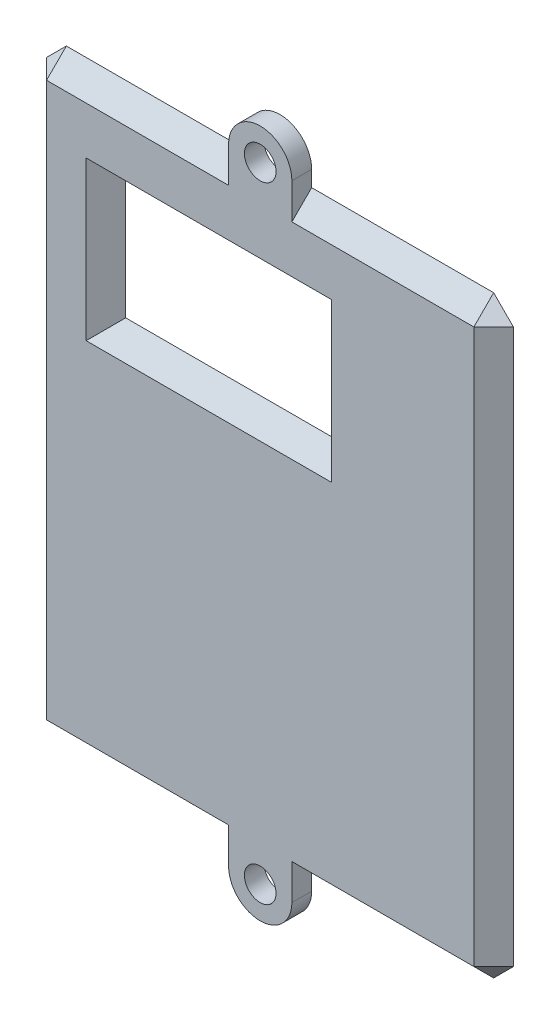
ISO-10303-21;
HEADER;
FILE_DESCRIPTION(('STEP AP214'),'2;1');
FILE_NAME('part.step','',(''),(''),'','','');
FILE_SCHEMA(('AUTOMOTIVE_DESIGN { 1 0 10303 214 1 1 1 1 }'));
ENDSEC;
DATA;
#1=APPLICATION_CONTEXT('core data for automotive mechanical design processes');
#2=APPLICATION_PROTOCOL_DEFINITION('international standard','automotive_design',2000,#1);
#3=PRODUCT_CONTEXT('',#1,'mechanical');
#4=PRODUCT('Part','Part','',(#3));
#5=PRODUCT_RELATED_PRODUCT_CATEGORY('part','',(#4));
#6=PRODUCT_DEFINITION_FORMATION('','',#4);
#7=PRODUCT_DEFINITION_CONTEXT('part definition',#1,'design');
#8=PRODUCT_DEFINITION('design','',#6,#7);
#9=PRODUCT_DEFINITION_SHAPE('','',#8);
#10=(LENGTH_UNIT() NAMED_UNIT(*) SI_UNIT(.MILLI.,.METRE.));
#11=(NAMED_UNIT(*) PLANE_ANGLE_UNIT() SI_UNIT($,.RADIAN.));
#12=(NAMED_UNIT(*) SI_UNIT($,.STERADIAN.) SOLID_ANGLE_UNIT());
#13=UNCERTAINTY_MEASURE_WITH_UNIT(LENGTH_MEASURE(1.E-05),#10,'distance_accuracy_value','');
#14=(GEOMETRIC_REPRESENTATION_CONTEXT(3) GLOBAL_UNCERTAINTY_ASSIGNED_CONTEXT((#13)) GLOBAL_UNIT_ASSIGNED_CONTEXT((#10,
#11,#12)) REPRESENTATION_CONTEXT('',''));
#15=CARTESIAN_POINT('',(0.,0.,0.));
#16=DIRECTION('',(0.,0.,1.));
#17=DIRECTION('',(1.,0.,0.));
#18=AXIS2_PLACEMENT_3D('',#15,#16,#17);
#19=CARTESIAN_POINT('',(37.465,97.79,3.175));
#20=DIRECTION('',(0.,0.,1.));
#21=DIRECTION('',(1.,0.,0.));
#22=AXIS2_PLACEMENT_3D('',#19,#20,#21);
#23=PLANE('',#22);
#24=DIRECTION('',(1.,0.,0.));
#25=VECTOR('',#24,1.);
#26=CARTESIAN_POINT('',(37.465,84.455,3.175));
#27=LINE('',#26,#25);
#28=CARTESIAN_POINT('',(9.52499999999997,84.455,3.175));
#29=VERTEX_POINT('',#28);
#30=CARTESIAN_POINT('',(48.895,84.455,3.175));
#31=VERTEX_POINT('',#30);
#32=EDGE_CURVE('E273',#29,#31,#27,.T.);
#33=ORIENTED_EDGE('',*,*,#32,.T.);
#34=DIRECTION('',(0.,-1.,0.));
#35=VECTOR('',#34,1.);
#36=CARTESIAN_POINT('',(48.895,97.79,3.175));
#37=LINE('',#36,#35);
#38=CARTESIAN_POINT('',(48.895,59.055,3.175));
#39=VERTEX_POINT('',#38);
#40=EDGE_CURVE('E275',#31,#39,#37,.T.);
#41=ORIENTED_EDGE('',*,*,#40,.T.);
#42=DIRECTION('',(-1.,0.,0.));
#43=VECTOR('',#42,1.);
#44=CARTESIAN_POINT('',(37.465,59.055,3.175));
#45=LINE('',#44,#43);
#46=CARTESIAN_POINT('',(9.52499999999997,59.055,3.175));
#47=VERTEX_POINT('',#46);
#48=EDGE_CURVE('E270',#39,#47,#45,.T.);
#49=ORIENTED_EDGE('',*,*,#48,.T.);
#50=DIRECTION('',(0.,1.,0.));
#51=VECTOR('',#50,1.);
#52=CARTESIAN_POINT('',(9.52499999999997,97.79,3.175));
#53=LINE('',#52,#51);
#54=EDGE_CURVE('E180',#47,#29,#53,.T.);
#55=ORIENTED_EDGE('',*,*,#54,.T.);
#56=EDGE_LOOP('',(#33,#41,#49,#55));
#57=FACE_BOUND('',#56,.T.);
#58=DIRECTION('',(0.,1.,0.));
#59=VECTOR('',#58,1.);
#60=CARTESIAN_POINT('',(42.545,-2.54,3.175));
#61=LINE('',#60,#59);
#62=CARTESIAN_POINT('',(42.545,-2.54,3.175));
#63=VERTEX_POINT('',#62);
#64=CARTESIAN_POINT('',(42.545,3.17500000000001,3.175));
#65=VERTEX_POINT('',#64);
#66=EDGE_CURVE('E211',#63,#65,#61,.T.);
#67=ORIENTED_EDGE('',*,*,#66,.T.);
#68=DIRECTION('',(1.,0.,0.));
#69=VECTOR('',#68,1.);
#70=CARTESIAN_POINT('',(74.93,3.17500000000001,3.175));
#71=LINE('',#70,#69);
#72=CARTESIAN_POINT('',(71.755,3.17500000000001,3.175));
#73=VERTEX_POINT('',#72);
#74=EDGE_CURVE('E268',#65,#73,#71,.T.);
#75=ORIENTED_EDGE('',*,*,#74,.T.);
#76=DIRECTION('',(0.,1.,0.));
#77=VECTOR('',#76,1.);
#78=CARTESIAN_POINT('',(71.755,95.25,3.175));
#79=LINE('',#78,#77);
#80=CARTESIAN_POINT('',(71.755,92.075,3.175));
#81=VERTEX_POINT('',#80);
#82=EDGE_CURVE('E263',#73,#81,#79,.T.);
#83=ORIENTED_EDGE('',*,*,#82,.T.);
#84=DIRECTION('',(-1.,0.,0.));
#85=VECTOR('',#84,1.);
#86=CARTESIAN_POINT('',(42.545,92.075,3.175));
#87=LINE('',#86,#85);
#88=CARTESIAN_POINT('',(42.545,92.075,3.175));
#89=VERTEX_POINT('',#88);
#90=EDGE_CURVE('E265',#81,#89,#87,.T.);
#91=ORIENTED_EDGE('',*,*,#90,.T.);
#92=DIRECTION('',(0.,1.,0.));
#93=VECTOR('',#92,1.);
#94=CARTESIAN_POINT('',(42.545,97.79,3.175));
#95=LINE('',#94,#93);
#96=CARTESIAN_POINT('',(42.545,97.79,3.175));
#97=VERTEX_POINT('',#96);
#98=EDGE_CURVE('E213',#89,#97,#95,.T.);
#99=ORIENTED_EDGE('',*,*,#98,.T.);
#100=CARTESIAN_POINT('',(37.465,97.79,3.175));
#101=DIRECTION('',(0.,0.,1.));
#102=DIRECTION('',(1.,0.,0.));
#103=AXIS2_PLACEMENT_3D('',#100,#101,#102);
#104=CIRCLE('',#103,5.08000000000001);
#105=CARTESIAN_POINT('',(32.385,97.79,3.175));
#106=VERTEX_POINT('',#105);
#107=EDGE_CURVE('E215',#97,#106,#104,.T.);
#108=ORIENTED_EDGE('',*,*,#107,.T.);
#109=DIRECTION('',(0.,-1.,0.));
#110=VECTOR('',#109,1.);
#111=CARTESIAN_POINT('',(32.385,97.79,3.175));
#112=LINE('',#111,#110);
#113=CARTESIAN_POINT('',(32.385,92.075,3.175));
#114=VERTEX_POINT('',#113);
#115=EDGE_CURVE('E217',#106,#114,#112,.T.);
#116=ORIENTED_EDGE('',*,*,#115,.T.);
#117=DIRECTION('',(-1.,0.,0.));
#118=VECTOR('',#117,1.);
#119=CARTESIAN_POINT('',(0.,92.075,3.175));
#120=LINE('',#119,#118);
#121=CARTESIAN_POINT('',(3.175,92.075,3.175));
#122=VERTEX_POINT('',#121);
#123=EDGE_CURVE('E258',#114,#122,#120,.T.);
#124=ORIENTED_EDGE('',*,*,#123,.T.);
#125=DIRECTION('',(0.,-1.,0.));
#126=VECTOR('',#125,1.);
#127=CARTESIAN_POINT('',(3.175,0.,3.175));
#128=LINE('',#127,#126);
#129=CARTESIAN_POINT('',(3.175,3.175,3.175));
#130=VERTEX_POINT('',#129);
#131=EDGE_CURVE('E256',#122,#130,#128,.T.);
#132=ORIENTED_EDGE('',*,*,#131,.T.);
#133=DIRECTION('',(1.,0.,0.));
#134=VECTOR('',#133,1.);
#135=CARTESIAN_POINT('',(32.385,3.175,3.175));
#136=LINE('',#135,#134);
#137=CARTESIAN_POINT('',(32.385,3.175,3.175));
#138=VERTEX_POINT('',#137);
#139=EDGE_CURVE('E260',#130,#138,#136,.T.);
#140=ORIENTED_EDGE('',*,*,#139,.T.);
#141=DIRECTION('',(0.,-1.,0.));
#142=VECTOR('',#141,1.);
#143=CARTESIAN_POINT('',(32.385,-2.54,3.175));
#144=LINE('',#143,#142);
#145=CARTESIAN_POINT('',(32.385,-2.54,3.175));
#146=VERTEX_POINT('',#145);
#147=EDGE_CURVE('E206',#138,#146,#144,.T.);
#148=ORIENTED_EDGE('',*,*,#147,.T.);
#149=CARTESIAN_POINT('',(37.465,-2.54,3.175));
#150=DIRECTION('',(0.,0.,1.));
#151=DIRECTION('',(1.,0.,0.));
#152=AXIS2_PLACEMENT_3D('',#149,#150,#151);
#153=CIRCLE('',#152,5.08);
#154=EDGE_CURVE('E208',#146,#63,#153,.T.);
#155=ORIENTED_EDGE('',*,*,#154,.T.);
#156=EDGE_LOOP('',(#67,#75,#83,#91,#99,#108,#116,#124,#132,#140,#148,#155));
#157=FACE_BOUND('',#156,.T.);
#158=CARTESIAN_POINT('',(37.465,-2.54,3.175));
#159=DIRECTION('',(0.,0.,1.));
#160=DIRECTION('',(1.,0.,0.));
#161=AXIS2_PLACEMENT_3D('',#158,#159,#160);
#162=CIRCLE('',#161,2.54);
#163=CARTESIAN_POINT('',(40.005,-2.54,3.175));
#164=VERTEX_POINT('',#163);
#165=EDGE_CURVE('E200',#164,#164,#162,.T.);
#166=ORIENTED_EDGE('',*,*,#165,.F.);
#167=EDGE_LOOP('',(#166));
#168=FACE_BOUND('',#167,.T.);
#169=CARTESIAN_POINT('',(37.465,97.79,3.175));
#170=DIRECTION('',(0.,0.,1.));
#171=DIRECTION('',(1.,0.,0.));
#172=AXIS2_PLACEMENT_3D('',#169,#170,#171);
#173=CIRCLE('',#172,2.54);
#174=CARTESIAN_POINT('',(40.005,97.79,3.175));
#175=VERTEX_POINT('',#174);
#176=EDGE_CURVE('E194',#175,#175,#173,.T.);
#177=ORIENTED_EDGE('',*,*,#176,.F.);
#178=EDGE_LOOP('',(#177));
#179=FACE_BOUND('',#178,.T.);
#180=ADVANCED_FACE('F33',(#57,#157,#168,#179),#23,.T.);
#181=CARTESIAN_POINT('',(37.465,97.79,0.));
#182=DIRECTION('',(0.,0.,1.));
#183=DIRECTION('',(1.,0.,0.));
#184=AXIS2_PLACEMENT_3D('',#181,#182,#183);
#185=PLANE('',#184);
#186=CARTESIAN_POINT('',(37.465,97.79,0.));
#187=DIRECTION('',(0.,0.,1.));
#188=DIRECTION('',(1.,0.,0.));
#189=AXIS2_PLACEMENT_3D('',#186,#187,#188);
#190=CIRCLE('',#189,2.54);
#191=CARTESIAN_POINT('',(40.005,97.79,0.));
#192=VERTEX_POINT('',#191);
#193=EDGE_CURVE('E193',#192,#192,#190,.T.);
#194=ORIENTED_EDGE('',*,*,#193,.T.);
#195=EDGE_LOOP('',(#194));
#196=FACE_BOUND('',#195,.T.);
#197=CARTESIAN_POINT('',(37.465,-2.54,0.));
#198=DIRECTION('',(0.,0.,1.));
#199=DIRECTION('',(1.,0.,0.));
#200=AXIS2_PLACEMENT_3D('',#197,#198,#199);
#201=CIRCLE('',#200,2.54);
#202=CARTESIAN_POINT('',(40.005,-2.54,0.));
#203=VERTEX_POINT('',#202);
#204=EDGE_CURVE('E197',#203,#203,#201,.T.);
#205=ORIENTED_EDGE('',*,*,#204,.T.);
#206=EDGE_LOOP('',(#205));
#207=FACE_BOUND('',#206,.T.);
#208=DIRECTION('',(0.,1.,0.));
#209=VECTOR('',#208,1.);
#210=CARTESIAN_POINT('',(74.93,0.,0.));
#211=LINE('',#210,#209);
#212=CARTESIAN_POINT('',(74.93,3.17500000000001,0.));
#213=VERTEX_POINT('',#212);
#214=CARTESIAN_POINT('',(74.93,92.075,0.));
#215=VERTEX_POINT('',#214);
#216=EDGE_CURVE('E231',#213,#215,#211,.T.);
#217=ORIENTED_EDGE('',*,*,#216,.F.);
#218=DIRECTION('',(0.707106781186548,0.707106781186548,0.));
#219=VECTOR('',#218,1.);
#220=CARTESIAN_POINT('',(74.93,3.17500000000001,0.));
#221=LINE('',#220,#219);
#222=CARTESIAN_POINT('',(71.755,0.,0.));
#223=VERTEX_POINT('',#222);
#224=EDGE_CURVE('E284',#213,#223,#221,.F.);
#225=ORIENTED_EDGE('',*,*,#224,.T.);
#226=DIRECTION('',(1.,0.,0.));
#227=VECTOR('',#226,1.);
#228=CARTESIAN_POINT('',(42.545,0.,0.));
#229=LINE('',#228,#227);
#230=CARTESIAN_POINT('',(42.545,0.,0.));
#231=VERTEX_POINT('',#230);
#232=EDGE_CURVE('E229',#231,#223,#229,.T.);
#233=ORIENTED_EDGE('',*,*,#232,.F.);
#234=DIRECTION('',(0.,1.,0.));
#235=VECTOR('',#234,1.);
#236=CARTESIAN_POINT('',(42.545,-2.54,0.));
#237=LINE('',#236,#235);
#238=CARTESIAN_POINT('',(42.545,-2.54,0.));
#239=VERTEX_POINT('',#238);
#240=EDGE_CURVE('E227',#239,#231,#237,.T.);
#241=ORIENTED_EDGE('',*,*,#240,.F.);
#242=CARTESIAN_POINT('',(37.465,-2.54,0.));
#243=DIRECTION('',(0.,0.,1.));
#244=DIRECTION('',(1.,0.,0.));
#245=AXIS2_PLACEMENT_3D('',#242,#243,#244);
#246=CIRCLE('',#245,5.08);
#247=CARTESIAN_POINT('',(32.385,-2.54,0.));
#248=VERTEX_POINT('',#247);
#249=EDGE_CURVE('E225',#248,#239,#246,.T.);
#250=ORIENTED_EDGE('',*,*,#249,.F.);
#251=DIRECTION('',(0.,-1.,0.));
#252=VECTOR('',#251,1.);
#253=CARTESIAN_POINT('',(32.385,-2.54,0.));
#254=LINE('',#253,#252);
#255=CARTESIAN_POINT('',(32.385,0.,0.));
#256=VERTEX_POINT('',#255);
#257=EDGE_CURVE('E223',#256,#248,#254,.T.);
#258=ORIENTED_EDGE('',*,*,#257,.F.);
#259=DIRECTION('',(1.,0.,0.));
#260=VECTOR('',#259,1.);
#261=CARTESIAN_POINT('',(0.,0.,0.));
#262=LINE('',#261,#260);
#263=CARTESIAN_POINT('',(3.175,0.,0.));
#264=VERTEX_POINT('',#263);
#265=EDGE_CURVE('E50',#264,#256,#262,.T.);
#266=ORIENTED_EDGE('',*,*,#265,.F.);
#267=DIRECTION('',(0.707106781186546,-0.707106781186549,0.));
#268=VECTOR('',#267,1.);
#269=CARTESIAN_POINT('',(3.175,0.,0.));
#270=LINE('',#269,#268);
#271=CARTESIAN_POINT('',(0.,3.17500000000001,0.));
#272=VERTEX_POINT('',#271);
#273=EDGE_CURVE('E280',#264,#272,#270,.F.);
#274=ORIENTED_EDGE('',*,*,#273,.T.);
#275=DIRECTION('',(0.,-1.,0.));
#276=VECTOR('',#275,1.);
#277=CARTESIAN_POINT('',(0.,0.,0.));
#278=LINE('',#277,#276);
#279=CARTESIAN_POINT('',(0.,92.075,0.));
#280=VERTEX_POINT('',#279);
#281=EDGE_CURVE('E203',#280,#272,#278,.T.);
#282=ORIENTED_EDGE('',*,*,#281,.F.);
#283=DIRECTION('',(-0.707106781186546,-0.707106781186549,0.));
#284=VECTOR('',#283,1.);
#285=CARTESIAN_POINT('',(0.,92.075,0.));
#286=LINE('',#285,#284);
#287=CARTESIAN_POINT('',(3.175,95.25,0.));
#288=VERTEX_POINT('',#287);
#289=EDGE_CURVE('E278',#280,#288,#286,.F.);
#290=ORIENTED_EDGE('',*,*,#289,.T.);
#291=DIRECTION('',(-1.,0.,0.));
#292=VECTOR('',#291,1.);
#293=CARTESIAN_POINT('',(0.,95.25,0.));
#294=LINE('',#293,#292);
#295=CARTESIAN_POINT('',(32.385,95.25,0.));
#296=VERTEX_POINT('',#295);
#297=EDGE_CURVE('E209',#296,#288,#294,.T.);
#298=ORIENTED_EDGE('',*,*,#297,.F.);
#299=DIRECTION('',(0.,-1.,0.));
#300=VECTOR('',#299,1.);
#301=CARTESIAN_POINT('',(32.385,97.79,0.));
#302=LINE('',#301,#300);
#303=CARTESIAN_POINT('',(32.385,97.79,0.));
#304=VERTEX_POINT('',#303);
#305=EDGE_CURVE('E241',#304,#296,#302,.T.);
#306=ORIENTED_EDGE('',*,*,#305,.F.);
#307=CARTESIAN_POINT('',(37.465,97.79,0.));
#308=DIRECTION('',(0.,0.,1.));
#309=DIRECTION('',(1.,0.,0.));
#310=AXIS2_PLACEMENT_3D('',#307,#308,#309);
#311=CIRCLE('',#310,5.08000000000001);
#312=CARTESIAN_POINT('',(42.545,97.79,0.));
#313=VERTEX_POINT('',#312);
#314=EDGE_CURVE('E239',#313,#304,#311,.T.);
#315=ORIENTED_EDGE('',*,*,#314,.F.);
#316=DIRECTION('',(0.,1.,0.));
#317=VECTOR('',#316,1.);
#318=CARTESIAN_POINT('',(42.545,97.79,0.));
#319=LINE('',#318,#317);
#320=CARTESIAN_POINT('',(42.545,95.25,0.));
#321=VERTEX_POINT('',#320);
#322=EDGE_CURVE('E237',#321,#313,#319,.T.);
#323=ORIENTED_EDGE('',*,*,#322,.F.);
#324=DIRECTION('',(-1.,0.,0.));
#325=VECTOR('',#324,1.);
#326=CARTESIAN_POINT('',(42.545,95.25,0.));
#327=LINE('',#326,#325);
#328=CARTESIAN_POINT('',(71.755,95.25,0.));
#329=VERTEX_POINT('',#328);
#330=EDGE_CURVE('E234',#329,#321,#327,.T.);
#331=ORIENTED_EDGE('',*,*,#330,.F.);
#332=DIRECTION('',(-0.707106781186548,0.707106781186548,0.));
#333=VECTOR('',#332,1.);
#334=CARTESIAN_POINT('',(71.755,95.25,0.));
#335=LINE('',#334,#333);
#336=EDGE_CURVE('E282',#329,#215,#335,.F.);
#337=ORIENTED_EDGE('',*,*,#336,.T.);
#338=EDGE_LOOP('',(#217,#225,#233,#241,#250,#258,#266,#274,#282,#290,#298,#306,#315,#323,#331,#337));
#339=FACE_BOUND('',#338,.T.);
#340=DIRECTION('',(0.,-1.,0.));
#341=VECTOR('',#340,1.);
#342=CARTESIAN_POINT('',(12.7,81.28,0.));
#343=LINE('',#342,#341);
#344=CARTESIAN_POINT('',(12.7,81.28,0.));
#345=VERTEX_POINT('',#344);
#346=CARTESIAN_POINT('',(12.7,62.23,0.));
#347=VERTEX_POINT('',#346);
#348=EDGE_CURVE('E163',#345,#347,#343,.T.);
#349=ORIENTED_EDGE('',*,*,#348,.T.);
#350=DIRECTION('',(1.,0.,0.));
#351=VECTOR('',#350,1.);
#352=CARTESIAN_POINT('',(12.7,62.23,0.));
#353=LINE('',#352,#351);
#354=CARTESIAN_POINT('',(45.72,62.23,0.));
#355=VERTEX_POINT('',#354);
#356=EDGE_CURVE('E168',#347,#355,#353,.T.);
#357=ORIENTED_EDGE('',*,*,#356,.T.);
#358=DIRECTION('',(0.,1.,0.));
#359=VECTOR('',#358,1.);
#360=CARTESIAN_POINT('',(45.72,81.28,0.));
#361=LINE('',#360,#359);
#362=CARTESIAN_POINT('',(45.72,81.28,0.));
#363=VERTEX_POINT('',#362);
#364=EDGE_CURVE('E188',#355,#363,#361,.T.);
#365=ORIENTED_EDGE('',*,*,#364,.T.);
#366=DIRECTION('',(-1.,0.,0.));
#367=VECTOR('',#366,1.);
#368=CARTESIAN_POINT('',(12.7,81.28,0.));
#369=LINE('',#368,#367);
#370=EDGE_CURVE('E171',#363,#345,#369,.T.);
#371=ORIENTED_EDGE('',*,*,#370,.T.);
#372=EDGE_LOOP('',(#349,#357,#365,#371));
#373=FACE_BOUND('',#372,.T.);
#374=ADVANCED_FACE('F165',(#196,#207,#339,#373),#185,.F.);
#375=CARTESIAN_POINT('',(32.385,-2.54,3.175));
#376=DIRECTION('',(1.,0.,0.));
#377=DIRECTION('',(0.,1.,0.));
#378=AXIS2_PLACEMENT_3D('',#375,#376,#377);
#379=PLANE('',#378);
#380=ORIENTED_EDGE('',*,*,#257,.T.);
#381=DIRECTION('',(0.,0.,-1.));
#382=VECTOR('',#381,1.);
#383=CARTESIAN_POINT('',(32.385,-2.54,3.175));
#384=LINE('',#383,#382);
#385=EDGE_CURVE('E253',#146,#248,#384,.T.);
#386=ORIENTED_EDGE('',*,*,#385,.F.);
#387=ORIENTED_EDGE('',*,*,#147,.F.);
#388=DIRECTION('',(0.,-0.707106781186546,-0.707106781186549));
#389=VECTOR('',#388,1.);
#390=CARTESIAN_POINT('',(32.385,0.317500000000011,0.317500000000001));
#391=LINE('',#390,#389);
#392=EDGE_CURVE('E42',#138,#256,#391,.T.);
#393=ORIENTED_EDGE('',*,*,#392,.T.);
#394=EDGE_LOOP('',(#380,#386,#387,#393));
#395=FACE_BOUND('',#394,.T.);
#396=ADVANCED_FACE('F378',(#395),#379,.F.);
#397=CARTESIAN_POINT('',(37.465,-2.54,3.175));
#398=DIRECTION('',(0.,0.,-1.));
#399=DIRECTION('',(-1.,0.,0.));
#400=AXIS2_PLACEMENT_3D('',#397,#398,#399);
#401=CYLINDRICAL_SURFACE('',#400,5.08);
#402=ORIENTED_EDGE('',*,*,#249,.T.);
#403=DIRECTION('',(0.,0.,-1.));
#404=VECTOR('',#403,1.);
#405=CARTESIAN_POINT('',(42.545,-2.54,3.175));
#406=LINE('',#405,#404);
#407=EDGE_CURVE('E250',#63,#239,#406,.T.);
#408=ORIENTED_EDGE('',*,*,#407,.F.);
#409=ORIENTED_EDGE('',*,*,#154,.F.);
#410=ORIENTED_EDGE('',*,*,#385,.T.);
#411=EDGE_LOOP('',(#402,#408,#409,#410));
#412=FACE_BOUND('',#411,.T.);
#413=ADVANCED_FACE('F395',(#412),#401,.T.);
#414=CARTESIAN_POINT('',(42.545,-2.54,3.175));
#415=DIRECTION('',(-1.,0.,0.));
#416=DIRECTION('',(0.,-1.,0.));
#417=AXIS2_PLACEMENT_3D('',#414,#415,#416);
#418=PLANE('',#417);
#419=ORIENTED_EDGE('',*,*,#240,.T.);
#420=DIRECTION('',(0.,0.707106781186548,0.707106781186548));
#421=VECTOR('',#420,1.);
#422=CARTESIAN_POINT('',(42.545,0.317500000000005,0.317499999999994));
#423=LINE('',#422,#421);
#424=EDGE_CURVE('E287',#231,#65,#423,.T.);
#425=ORIENTED_EDGE('',*,*,#424,.T.);
#426=ORIENTED_EDGE('',*,*,#66,.F.);
#427=ORIENTED_EDGE('',*,*,#407,.T.);
#428=EDGE_LOOP('',(#419,#425,#426,#427));
#429=FACE_BOUND('',#428,.T.);
#430=ADVANCED_FACE('F392',(#429),#418,.F.);
#431=CARTESIAN_POINT('',(42.545,97.79,3.175));
#432=DIRECTION('',(-1.,0.,0.));
#433=DIRECTION('',(0.,0.,1.));
#434=AXIS2_PLACEMENT_3D('',#431,#432,#433);
#435=PLANE('',#434);
#436=ORIENTED_EDGE('',*,*,#322,.T.);
#437=DIRECTION('',(0.,0.,-1.));
#438=VECTOR('',#437,1.);
#439=CARTESIAN_POINT('',(42.545,97.79,3.175));
#440=LINE('',#439,#438);
#441=EDGE_CURVE('E247',#97,#313,#440,.T.);
#442=ORIENTED_EDGE('',*,*,#441,.F.);
#443=ORIENTED_EDGE('',*,*,#98,.F.);
#444=DIRECTION('',(0.,0.707106781186548,-0.707106781186548));
#445=VECTOR('',#444,1.);
#446=CARTESIAN_POINT('',(42.545,94.9325,0.317499999999994));
#447=LINE('',#446,#445);
#448=EDGE_CURVE('E290',#89,#321,#447,.T.);
#449=ORIENTED_EDGE('',*,*,#448,.T.);
#450=EDGE_LOOP('',(#436,#442,#443,#449));
#451=FACE_BOUND('',#450,.T.);
#452=ADVANCED_FACE('F389',(#451),#435,.F.);
#453=CARTESIAN_POINT('',(37.465,97.79,3.175));
#454=DIRECTION('',(0.,0.,-1.));
#455=DIRECTION('',(-1.,0.,0.));
#456=AXIS2_PLACEMENT_3D('',#453,#454,#455);
#457=CYLINDRICAL_SURFACE('',#456,5.08000000000001);
#458=ORIENTED_EDGE('',*,*,#314,.T.);
#459=DIRECTION('',(0.,0.,-1.));
#460=VECTOR('',#459,1.);
#461=CARTESIAN_POINT('',(32.385,97.79,3.175));
#462=LINE('',#461,#460);
#463=EDGE_CURVE('E219',#106,#304,#462,.T.);
#464=ORIENTED_EDGE('',*,*,#463,.F.);
#465=ORIENTED_EDGE('',*,*,#107,.F.);
#466=ORIENTED_EDGE('',*,*,#441,.T.);
#467=EDGE_LOOP('',(#458,#464,#465,#466));
#468=FACE_BOUND('',#467,.T.);
#469=ADVANCED_FACE('F344',(#468),#457,.T.);
#470=CARTESIAN_POINT('',(32.385,97.79,3.175));
#471=DIRECTION('',(1.,0.,0.));
#472=DIRECTION('',(0.,0.,-1.));
#473=AXIS2_PLACEMENT_3D('',#470,#471,#472);
#474=PLANE('',#473);
#475=ORIENTED_EDGE('',*,*,#305,.T.);
#476=DIRECTION('',(0.,-0.707106781186546,0.707106781186549));
#477=VECTOR('',#476,1.);
#478=CARTESIAN_POINT('',(32.385,94.9325,0.317500000000001));
#479=LINE('',#478,#477);
#480=EDGE_CURVE('E11',#296,#114,#479,.T.);
#481=ORIENTED_EDGE('',*,*,#480,.T.);
#482=ORIENTED_EDGE('',*,*,#115,.F.);
#483=ORIENTED_EDGE('',*,*,#463,.T.);
#484=EDGE_LOOP('',(#475,#481,#482,#483));
#485=FACE_BOUND('',#484,.T.);
#486=ADVANCED_FACE('F342',(#485),#474,.F.);
#487=CARTESIAN_POINT('',(37.465,-2.54,3.175));
#488=DIRECTION('',(0.,0.,-1.));
#489=DIRECTION('',(-1.,0.,0.));
#490=AXIS2_PLACEMENT_3D('',#487,#488,#489);
#491=CYLINDRICAL_SURFACE('',#490,2.54);
#492=ORIENTED_EDGE('',*,*,#165,.T.);
#493=EDGE_LOOP('',(#492));
#494=FACE_BOUND('',#493,.T.);
#495=ORIENTED_EDGE('',*,*,#204,.F.);
#496=EDGE_LOOP('',(#495));
#497=FACE_BOUND('',#496,.T.);
#498=ADVANCED_FACE('F382',(#494,#497),#491,.F.);
#499=CARTESIAN_POINT('',(37.465,97.79,3.175));
#500=DIRECTION('',(0.,0.,-1.));
#501=DIRECTION('',(-1.,0.,0.));
#502=AXIS2_PLACEMENT_3D('',#499,#500,#501);
#503=CYLINDRICAL_SURFACE('',#502,2.54);
#504=ORIENTED_EDGE('',*,*,#176,.T.);
#505=EDGE_LOOP('',(#504));
#506=FACE_BOUND('',#505,.T.);
#507=ORIENTED_EDGE('',*,*,#193,.F.);
#508=EDGE_LOOP('',(#507));
#509=FACE_BOUND('',#508,.T.);
#510=ADVANCED_FACE('F413',(#506,#509),#503,.F.);
#511=CARTESIAN_POINT('',(12.7,81.28,0.));
#512=DIRECTION('',(-0.707106781186544,0.,-0.707106781186551));
#513=DIRECTION('',(0.,-1.,0.));
#514=AXIS2_PLACEMENT_3D('',#511,#512,#513);
#515=PLANE('',#514);
#516=DIRECTION('',(-0.577350269189628,0.577350269189628,0.577350269189622));
#517=VECTOR('',#516,1.);
#518=CARTESIAN_POINT('',(12.7,81.28,0.));
#519=LINE('',#518,#517);
#520=EDGE_CURVE('E183',#29,#345,#519,.F.);
#521=ORIENTED_EDGE('',*,*,#520,.F.);
#522=ORIENTED_EDGE('',*,*,#54,.F.);
#523=DIRECTION('',(-0.577350269189628,-0.577350269189628,0.577350269189622));
#524=VECTOR('',#523,1.);
#525=CARTESIAN_POINT('',(19.05,68.58,-6.34999999999998));
#526=LINE('',#525,#524);
#527=EDGE_CURVE('E175',#347,#47,#526,.T.);
#528=ORIENTED_EDGE('',*,*,#527,.F.);
#529=ORIENTED_EDGE('',*,*,#348,.F.);
#530=EDGE_LOOP('',(#521,#522,#528,#529));
#531=FACE_BOUND('',#530,.T.);
#532=ADVANCED_FACE('F179',(#531),#515,.F.);
#533=CARTESIAN_POINT('',(12.7,62.23,0.));
#534=DIRECTION('',(0.,-0.707106781186544,-0.707106781186551));
#535=DIRECTION('',(1.,0.,0.));
#536=AXIS2_PLACEMENT_3D('',#533,#534,#535);
#537=PLANE('',#536);
#538=ORIENTED_EDGE('',*,*,#527,.T.);
#539=ORIENTED_EDGE('',*,*,#48,.F.);
#540=DIRECTION('',(-0.577350269189628,0.577350269189628,-0.577350269189622));
#541=VECTOR('',#540,1.);
#542=CARTESIAN_POINT('',(39.37,68.58,-6.34999999999998));
#543=LINE('',#542,#541);
#544=EDGE_CURVE('E186',#355,#39,#543,.F.);
#545=ORIENTED_EDGE('',*,*,#544,.F.);
#546=ORIENTED_EDGE('',*,*,#356,.F.);
#547=EDGE_LOOP('',(#538,#539,#545,#546));
#548=FACE_BOUND('',#547,.T.);
#549=ADVANCED_FACE('F185',(#548),#537,.F.);
#550=CARTESIAN_POINT('',(12.7,81.28,0.));
#551=DIRECTION('',(0.,0.707106781186544,-0.707106781186551));
#552=DIRECTION('',(-1.,0.,0.));
#553=AXIS2_PLACEMENT_3D('',#550,#551,#552);
#554=PLANE('',#553);
#555=ORIENTED_EDGE('',*,*,#520,.T.);
#556=ORIENTED_EDGE('',*,*,#370,.F.);
#557=DIRECTION('',(0.577350269189628,0.577350269189627,0.577350269189622));
#558=VECTOR('',#557,1.);
#559=CARTESIAN_POINT('',(45.72,81.28,0.));
#560=LINE('',#559,#558);
#561=EDGE_CURVE('E293',#31,#363,#560,.F.);
#562=ORIENTED_EDGE('',*,*,#561,.F.);
#563=ORIENTED_EDGE('',*,*,#32,.F.);
#564=EDGE_LOOP('',(#555,#556,#562,#563));
#565=FACE_BOUND('',#564,.T.);
#566=ADVANCED_FACE('F406',(#565),#554,.F.);
#567=CARTESIAN_POINT('',(45.72,81.28,0.));
#568=DIRECTION('',(0.707106781186544,0.,-0.707106781186551));
#569=DIRECTION('',(0.,1.,0.));
#570=AXIS2_PLACEMENT_3D('',#567,#568,#569);
#571=PLANE('',#570);
#572=ORIENTED_EDGE('',*,*,#544,.T.);
#573=ORIENTED_EDGE('',*,*,#40,.F.);
#574=ORIENTED_EDGE('',*,*,#561,.T.);
#575=ORIENTED_EDGE('',*,*,#364,.F.);
#576=EDGE_LOOP('',(#572,#573,#574,#575));
#577=FACE_BOUND('',#576,.T.);
#578=ADVANCED_FACE('F403',(#577),#571,.F.);
#579=CARTESIAN_POINT('',(37.465,92.075,3.175));
#580=DIRECTION('',(0.,0.707106781186548,0.707106781186548));
#581=DIRECTION('',(1.,0.,0.));
#582=AXIS2_PLACEMENT_3D('',#579,#580,#581);
#583=PLANE('',#582);
#584=ORIENTED_EDGE('',*,*,#448,.F.);
#585=ORIENTED_EDGE('',*,*,#90,.F.);
#586=DIRECTION('',(0.,-0.707106781186548,0.707106781186548));
#587=VECTOR('',#586,1.);
#588=CARTESIAN_POINT('',(71.755,93.6625,1.58749999999999));
#589=LINE('',#588,#587);
#590=EDGE_CURVE('E295',#329,#81,#589,.T.);
#591=ORIENTED_EDGE('',*,*,#590,.F.);
#592=ORIENTED_EDGE('',*,*,#330,.T.);
#593=EDGE_LOOP('',(#584,#585,#591,#592));
#594=FACE_BOUND('',#593,.T.);
#595=ADVANCED_FACE('F351',(#594),#583,.T.);
#596=CARTESIAN_POINT('',(74.93,92.075,0.));
#597=DIRECTION('',(0.577350269189626,0.577350269189626,0.577350269189626));
#598=DIRECTION('',(0.707106781186548,0.,-0.707106781186547));
#599=AXIS2_PLACEMENT_3D('',#596,#597,#598);
#600=PLANE('',#599);
#601=ORIENTED_EDGE('',*,*,#336,.F.);
#602=ORIENTED_EDGE('',*,*,#590,.T.);
#603=DIRECTION('',(0.707106781186548,0.,-0.707106781186548));
#604=VECTOR('',#603,1.);
#605=CARTESIAN_POINT('',(74.93,92.075,0.));
#606=LINE('',#605,#604);
#607=EDGE_CURVE('E301',#215,#81,#606,.F.);
#608=ORIENTED_EDGE('',*,*,#607,.F.);
#609=EDGE_LOOP('',(#601,#602,#608));
#610=FACE_BOUND('',#609,.T.);
#611=ADVANCED_FACE('F356',(#610),#600,.T.);
#612=CARTESIAN_POINT('',(37.465,3.17500000000001,3.175));
#613=DIRECTION('',(0.,-0.707106781186548,0.707106781186548));
#614=DIRECTION('',(-1.,0.,0.));
#615=AXIS2_PLACEMENT_3D('',#612,#613,#614);
#616=PLANE('',#615);
#617=ORIENTED_EDGE('',*,*,#424,.F.);
#618=ORIENTED_EDGE('',*,*,#232,.T.);
#619=DIRECTION('',(0.,-0.707106781186548,-0.707106781186548));
#620=VECTOR('',#619,1.);
#621=CARTESIAN_POINT('',(71.755,0.,0.));
#622=LINE('',#621,#620);
#623=EDGE_CURVE('E58',#73,#223,#622,.T.);
#624=ORIENTED_EDGE('',*,*,#623,.F.);
#625=ORIENTED_EDGE('',*,*,#74,.F.);
#626=EDGE_LOOP('',(#617,#618,#624,#625));
#627=FACE_BOUND('',#626,.T.);
#628=ADVANCED_FACE('F369',(#627),#616,.T.);
#629=CARTESIAN_POINT('',(71.755,97.79,3.175));
#630=DIRECTION('',(0.707106781186548,0.,0.707106781186548));
#631=DIRECTION('',(0.,-1.,0.));
#632=AXIS2_PLACEMENT_3D('',#629,#630,#631);
#633=PLANE('',#632);
#634=ORIENTED_EDGE('',*,*,#607,.T.);
#635=ORIENTED_EDGE('',*,*,#82,.F.);
#636=DIRECTION('',(-0.707106781186548,0.,0.707106781186548));
#637=VECTOR('',#636,1.);
#638=CARTESIAN_POINT('',(73.3425,3.17500000000001,1.58749999999999));
#639=LINE('',#638,#637);
#640=EDGE_CURVE('E298',#213,#73,#639,.T.);
#641=ORIENTED_EDGE('',*,*,#640,.F.);
#642=ORIENTED_EDGE('',*,*,#216,.T.);
#643=EDGE_LOOP('',(#634,#635,#641,#642));
#644=FACE_BOUND('',#643,.T.);
#645=ADVANCED_FACE('F361',(#644),#633,.T.);
#646=CARTESIAN_POINT('',(71.755,0.,0.));
#647=DIRECTION('',(0.577350269189626,-0.577350269189626,0.577350269189626));
#648=DIRECTION('',(0.707106781186548,0.,-0.707106781186547));
#649=AXIS2_PLACEMENT_3D('',#646,#647,#648);
#650=PLANE('',#649);
#651=ORIENTED_EDGE('',*,*,#224,.F.);
#652=ORIENTED_EDGE('',*,*,#640,.T.);
#653=ORIENTED_EDGE('',*,*,#623,.T.);
#654=EDGE_LOOP('',(#651,#652,#653));
#655=FACE_BOUND('',#654,.T.);
#656=ADVANCED_FACE('F362',(#655),#650,.T.);
#657=CARTESIAN_POINT('',(37.465,92.075,3.175));
#658=DIRECTION('',(0.,0.707106781186549,0.707106781186546));
#659=DIRECTION('',(1.,0.,0.));
#660=AXIS2_PLACEMENT_3D('',#657,#658,#659);
#661=PLANE('',#660);
#662=ORIENTED_EDGE('',*,*,#480,.F.);
#663=ORIENTED_EDGE('',*,*,#297,.T.);
#664=DIRECTION('',(0.,0.707106781186546,-0.707106781186549));
#665=VECTOR('',#664,1.);
#666=CARTESIAN_POINT('',(3.175,95.25,0.));
#667=LINE('',#666,#665);
#668=EDGE_CURVE('E37',#122,#288,#667,.T.);
#669=ORIENTED_EDGE('',*,*,#668,.F.);
#670=ORIENTED_EDGE('',*,*,#123,.F.);
#671=EDGE_LOOP('',(#662,#663,#669,#670));
#672=FACE_BOUND('',#671,.T.);
#673=ADVANCED_FACE('F35',(#672),#661,.T.);
#674=CARTESIAN_POINT('',(3.175,95.25,0.));
#675=DIRECTION('',(-0.577350269189628,0.577350269189626,0.577350269189623));
#676=DIRECTION('',(-0.707106781186546,-0.707106781186549,0.));
#677=AXIS2_PLACEMENT_3D('',#674,#675,#676);
#678=PLANE('',#677);
#679=ORIENTED_EDGE('',*,*,#668,.T.);
#680=ORIENTED_EDGE('',*,*,#289,.F.);
#681=DIRECTION('',(0.707106781186546,0.,0.707106781186549));
#682=VECTOR('',#681,1.);
#683=CARTESIAN_POINT('',(1.5875,92.075,1.58749999999999));
#684=LINE('',#683,#682);
#685=EDGE_CURVE('E310',#122,#280,#684,.F.);
#686=ORIENTED_EDGE('',*,*,#685,.F.);
#687=EDGE_LOOP('',(#679,#680,#686));
#688=FACE_BOUND('',#687,.T.);
#689=ADVANCED_FACE('F319',(#688),#678,.T.);
#690=CARTESIAN_POINT('',(3.175,97.79,3.175));
#691=DIRECTION('',(-0.707106781186549,0.,0.707106781186546));
#692=DIRECTION('',(0.,1.,0.));
#693=AXIS2_PLACEMENT_3D('',#690,#691,#692);
#694=PLANE('',#693);
#695=ORIENTED_EDGE('',*,*,#685,.T.);
#696=ORIENTED_EDGE('',*,*,#281,.T.);
#697=DIRECTION('',(-0.707106781186546,0.,-0.707106781186549));
#698=VECTOR('',#697,1.);
#699=CARTESIAN_POINT('',(0.,3.17500000000001,0.));
#700=LINE('',#699,#698);
#701=EDGE_CURVE('E309',#130,#272,#700,.T.);
#702=ORIENTED_EDGE('',*,*,#701,.F.);
#703=ORIENTED_EDGE('',*,*,#131,.F.);
#704=EDGE_LOOP('',(#695,#696,#702,#703));
#705=FACE_BOUND('',#704,.T.);
#706=ADVANCED_FACE('F328',(#705),#694,.T.);
#707=CARTESIAN_POINT('',(37.465,3.175,3.175));
#708=DIRECTION('',(0.,-0.707106781186549,0.707106781186546));
#709=DIRECTION('',(-1.,0.,0.));
#710=AXIS2_PLACEMENT_3D('',#707,#708,#709);
#711=PLANE('',#710);
#712=ORIENTED_EDGE('',*,*,#392,.F.);
#713=ORIENTED_EDGE('',*,*,#139,.F.);
#714=DIRECTION('',(0.,0.707106781186546,0.707106781186549));
#715=VECTOR('',#714,1.);
#716=CARTESIAN_POINT('',(3.175,1.5875,1.58749999999999));
#717=LINE('',#716,#715);
#718=EDGE_CURVE('E306',#264,#130,#717,.T.);
#719=ORIENTED_EDGE('',*,*,#718,.F.);
#720=ORIENTED_EDGE('',*,*,#265,.T.);
#721=EDGE_LOOP('',(#712,#713,#719,#720));
#722=FACE_BOUND('',#721,.T.);
#723=ADVANCED_FACE('F334',(#722),#711,.T.);
#724=CARTESIAN_POINT('',(0.,3.17500000000001,0.));
#725=DIRECTION('',(-0.577350269189628,-0.577350269189626,0.577350269189623));
#726=DIRECTION('',(0.707106781186546,-0.707106781186549,0.));
#727=AXIS2_PLACEMENT_3D('',#724,#725,#726);
#728=PLANE('',#727);
#729=ORIENTED_EDGE('',*,*,#273,.F.);
#730=ORIENTED_EDGE('',*,*,#718,.T.);
#731=ORIENTED_EDGE('',*,*,#701,.T.);
#732=EDGE_LOOP('',(#729,#730,#731));
#733=FACE_BOUND('',#732,.T.);
#734=ADVANCED_FACE('F330',(#733),#728,.T.);
#735=CLOSED_SHELL('',(#180,#374,#396,#413,#430,#452,#469,#486,#498,#510,#532,#549,#566,#578,
#595,#611,#628,#645,#656,#673,#689,#706,#723,#734));
#736=MANIFOLD_SOLID_BREP('B2',#735);
#737=ADVANCED_BREP_SHAPE_REPRESENTATION('',(#18,#736),#14);
#738=SHAPE_DEFINITION_REPRESENTATION(#9,#737);
ENDSEC;
END-ISO-10303-21;
